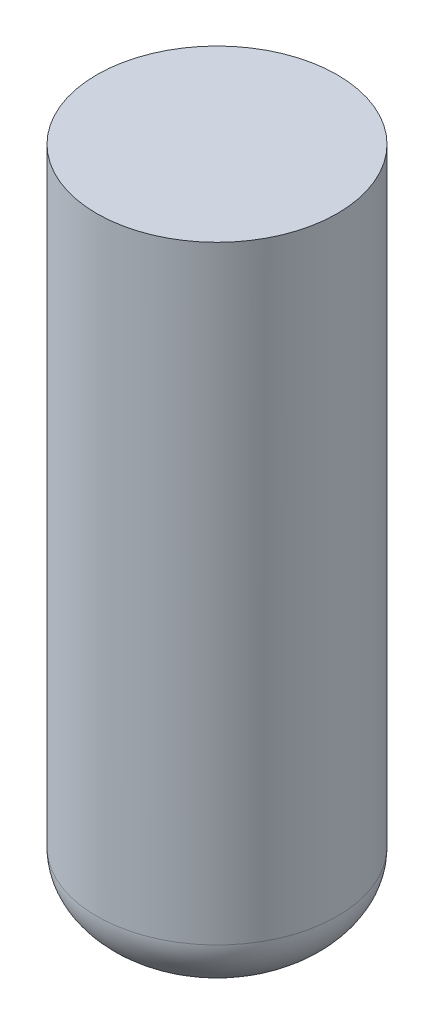
ISO-10303-21;
HEADER;
FILE_DESCRIPTION(('STEP AP214'),'2;1');
FILE_NAME('part.step','',(''),(''),'','','');
FILE_SCHEMA(('AUTOMOTIVE_DESIGN { 1 0 10303 214 1 1 1 1 }'));
ENDSEC;
DATA;
#1=APPLICATION_CONTEXT('core data for automotive mechanical design processes');
#2=APPLICATION_PROTOCOL_DEFINITION('international standard','automotive_design',2000,#1);
#3=PRODUCT_CONTEXT('',#1,'mechanical');
#4=PRODUCT('Part','Part','',(#3));
#5=PRODUCT_RELATED_PRODUCT_CATEGORY('part','',(#4));
#6=PRODUCT_DEFINITION_FORMATION('','',#4);
#7=PRODUCT_DEFINITION_CONTEXT('part definition',#1,'design');
#8=PRODUCT_DEFINITION('design','',#6,#7);
#9=PRODUCT_DEFINITION_SHAPE('','',#8);
#10=(LENGTH_UNIT() NAMED_UNIT(*) SI_UNIT(.MILLI.,.METRE.));
#11=(NAMED_UNIT(*) PLANE_ANGLE_UNIT() SI_UNIT($,.RADIAN.));
#12=(NAMED_UNIT(*) SI_UNIT($,.STERADIAN.) SOLID_ANGLE_UNIT());
#13=UNCERTAINTY_MEASURE_WITH_UNIT(LENGTH_MEASURE(1.E-05),#10,'distance_accuracy_value','');
#14=(GEOMETRIC_REPRESENTATION_CONTEXT(3) GLOBAL_UNCERTAINTY_ASSIGNED_CONTEXT((#13)) GLOBAL_UNIT_ASSIGNED_CONTEXT((#10,
#11,#12)) REPRESENTATION_CONTEXT('',''));
#15=CARTESIAN_POINT('',(0.,0.,0.));
#16=DIRECTION('',(0.,0.,1.));
#17=DIRECTION('',(1.,0.,0.));
#18=AXIS2_PLACEMENT_3D('',#15,#16,#17);
#19=CARTESIAN_POINT('',(0.,482.6,0.));
#20=DIRECTION('',(0.,-1.,0.));
#21=DIRECTION('',(0.,0.,-1.));
#22=AXIS2_PLACEMENT_3D('',#19,#20,#21);
#23=CYLINDRICAL_SURFACE('',#22,95.25);
#24=CARTESIAN_POINT('',(0.,2.22044604925031E-13,0.));
#25=DIRECTION('',(0.,-1.,0.));
#26=DIRECTION('',(0.,0.,-1.));
#27=AXIS2_PLACEMENT_3D('',#24,#25,#26);
#28=CIRCLE('',#27,95.25);
#29=CARTESIAN_POINT('',(0.,2.22044604925031E-13,-95.25));
#30=VERTEX_POINT('',#29);
#31=EDGE_CURVE('E11',#30,#30,#28,.T.);
#32=ORIENTED_EDGE('',*,*,#31,.F.);
#33=EDGE_LOOP('',(#32));
#34=FACE_BOUND('',#33,.T.);
#35=CARTESIAN_POINT('',(0.,482.092,0.));
#36=DIRECTION('',(0.,1.,0.));
#37=DIRECTION('',(0.,0.,1.));
#38=AXIS2_PLACEMENT_3D('',#35,#36,#37);
#39=CIRCLE('',#38,95.25);
#40=CARTESIAN_POINT('',(0.,482.092,95.25));
#41=VERTEX_POINT('',#40);
#42=EDGE_CURVE('E44',#41,#41,#39,.T.);
#43=ORIENTED_EDGE('',*,*,#42,.F.);
#44=EDGE_LOOP('',(#43));
#45=FACE_BOUND('',#44,.T.);
#46=ADVANCED_FACE('F38',(#34,#45),#23,.T.);
#47=CARTESIAN_POINT('',(0.,0.,0.));
#48=DIRECTION('',(1.,0.,0.));
#49=DIRECTION('',(0.,0.,-1.));
#50=AXIS2_PLACEMENT_3D('',#47,#48,#49);
#51=ELLIPSE('',#50,95.25,59.69);
#52=TRIMMED_CURVE('',#51,(PARAMETER_VALUE(4.71238898038469)),
(PARAMETER_VALUE(7.85398163397448)),.T.,.PARAMETER.);
#53=CARTESIAN_POINT('',(0.,-59.69,0.));
#54=DIRECTION('',(0.,-1.,0.));
#55=AXIS1_PLACEMENT('',#53,#54);
#56=SURFACE_OF_REVOLUTION('',#52,#55);
#57=ORIENTED_EDGE('',*,*,#31,.T.);
#58=EDGE_LOOP('',(#57));
#59=FACE_BOUND('',#58,.T.);
#60=CARTESIAN_POINT('',(0.,-59.69,0.));
#61=VERTEX_POINT('',#60);
#62=VERTEX_LOOP('',#61);
#63=FACE_BOUND('',#62,.T.);
#64=ADVANCED_FACE('F47',(#59,#63),#56,.F.);
#65=CARTESIAN_POINT('',(0.,482.092,0.));
#66=DIRECTION('',(0.,1.,0.));
#67=DIRECTION('',(0.,0.,1.));
#68=AXIS2_PLACEMENT_3D('',#65,#66,#67);
#69=PLANE('',#68);
#70=ORIENTED_EDGE('',*,*,#42,.T.);
#71=EDGE_LOOP('',(#70));
#72=FACE_BOUND('',#71,.T.);
#73=ADVANCED_FACE('F49',(#72),#69,.T.);
#74=CLOSED_SHELL('',(#46,#64,#73));
#75=MANIFOLD_SOLID_BREP('B2',#74);
#76=ADVANCED_BREP_SHAPE_REPRESENTATION('',(#18,#75),#14);
#77=SHAPE_DEFINITION_REPRESENTATION(#9,#76);
ENDSEC;
END-ISO-10303-21;
